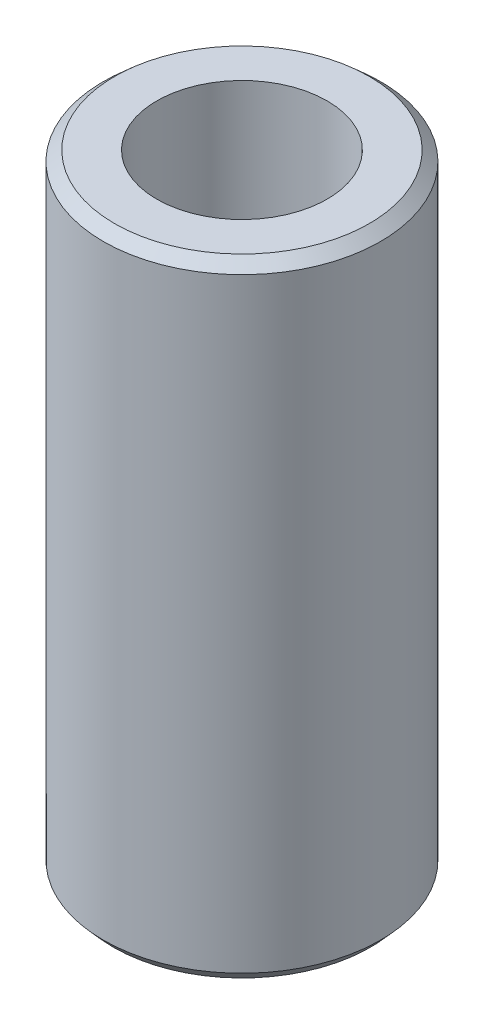
ISO-10303-21;
HEADER;
FILE_DESCRIPTION(('STEP AP214'),'2;1');
FILE_NAME('part.step','',(''),(''),'','','');
FILE_SCHEMA(('AUTOMOTIVE_DESIGN { 1 0 10303 214 1 1 1 1 }'));
ENDSEC;
DATA;
#1=APPLICATION_CONTEXT('core data for automotive mechanical design processes');
#2=APPLICATION_PROTOCOL_DEFINITION('international standard','automotive_design',2000,#1);
#3=PRODUCT_CONTEXT('',#1,'mechanical');
#4=PRODUCT('Part','Part','',(#3));
#5=PRODUCT_RELATED_PRODUCT_CATEGORY('part','',(#4));
#6=PRODUCT_DEFINITION_FORMATION('','',#4);
#7=PRODUCT_DEFINITION_CONTEXT('part definition',#1,'design');
#8=PRODUCT_DEFINITION('design','',#6,#7);
#9=PRODUCT_DEFINITION_SHAPE('','',#8);
#10=(LENGTH_UNIT() NAMED_UNIT(*) SI_UNIT(.MILLI.,.METRE.));
#11=(NAMED_UNIT(*) PLANE_ANGLE_UNIT() SI_UNIT($,.RADIAN.));
#12=(NAMED_UNIT(*) SI_UNIT($,.STERADIAN.) SOLID_ANGLE_UNIT());
#13=UNCERTAINTY_MEASURE_WITH_UNIT(LENGTH_MEASURE(1.E-05),#10,'distance_accuracy_value','');
#14=(GEOMETRIC_REPRESENTATION_CONTEXT(3) GLOBAL_UNCERTAINTY_ASSIGNED_CONTEXT((#13)) GLOBAL_UNIT_ASSIGNED_CONTEXT((#10,
#11,#12)) REPRESENTATION_CONTEXT('',''));
#15=CARTESIAN_POINT('',(0.,0.,0.));
#16=DIRECTION('',(0.,0.,1.));
#17=DIRECTION('',(1.,0.,0.));
#18=AXIS2_PLACEMENT_3D('',#15,#16,#17);
#19=CARTESIAN_POINT('',(0.,90.3573733337764,0.));
#20=DIRECTION('',(0.,-1.,0.));
#21=DIRECTION('',(0.,0.,-1.));
#22=AXIS2_PLACEMENT_3D('',#19,#20,#21);
#23=CYLINDRICAL_SURFACE('',#22,20.);
#24=CARTESIAN_POINT('',(0.,88.9192004763787,0.));
#25=DIRECTION('',(0.,1.,0.));
#26=DIRECTION('',(0.,0.,1.));
#27=AXIS2_PLACEMENT_3D('',#24,#25,#26);
#28=CIRCLE('',#27,20.);
#29=CARTESIAN_POINT('',(0.,88.9192004763787,20.));
#30=VERTEX_POINT('',#29);
#31=EDGE_CURVE('E50',#30,#30,#28,.F.);
#32=ORIENTED_EDGE('',*,*,#31,.T.);
#33=EDGE_LOOP('',(#32));
#34=FACE_BOUND('',#33,.T.);
#35=CARTESIAN_POINT('',(0.,1.61076154303533,0.));
#36=DIRECTION('',(0.,1.,0.));
#37=DIRECTION('',(0.,0.,1.));
#38=AXIS2_PLACEMENT_3D('',#35,#36,#37);
#39=CIRCLE('',#38,20.);
#40=CARTESIAN_POINT('',(0.,1.61076154303533,20.));
#41=VERTEX_POINT('',#40);
#42=EDGE_CURVE('E51',#41,#41,#39,.T.);
#43=ORIENTED_EDGE('',*,*,#42,.T.);
#44=EDGE_LOOP('',(#43));
#45=FACE_BOUND('',#44,.T.);
#46=ADVANCED_FACE('F39',(#34,#45),#23,.T.);
#47=CARTESIAN_POINT('',(0.,90.3573733337764,0.));
#48=DIRECTION('',(0.,1.,0.));
#49=DIRECTION('',(0.,0.,1.));
#50=AXIS2_PLACEMENT_3D('',#47,#48,#49);
#51=PLANE('',#50);
#52=CARTESIAN_POINT('',(0.,90.3573733337764,0.));
#53=DIRECTION('',(0.,1.,0.));
#54=DIRECTION('',(0.,0.,1.));
#55=AXIS2_PLACEMENT_3D('',#52,#53,#54);
#56=CIRCLE('',#55,18.3892384569647);
#57=CARTESIAN_POINT('',(0.,90.3573733337764,18.3892384569647));
#58=VERTEX_POINT('',#57);
#59=EDGE_CURVE('E54',#58,#58,#56,.T.);
#60=ORIENTED_EDGE('',*,*,#59,.T.);
#61=EDGE_LOOP('',(#60));
#62=FACE_BOUND('',#61,.T.);
#63=CARTESIAN_POINT('',(0.,90.3573733337764,0.));
#64=DIRECTION('',(0.,1.,0.));
#65=DIRECTION('',(0.,0.,1.));
#66=AXIS2_PLACEMENT_3D('',#63,#64,#65);
#67=CIRCLE('',#66,12.2946007790817);
#68=CARTESIAN_POINT('',(0.,90.3573733337764,12.2946007790817));
#69=VERTEX_POINT('',#68);
#70=EDGE_CURVE('E58',#69,#69,#67,.T.);
#71=ORIENTED_EDGE('',*,*,#70,.F.);
#72=EDGE_LOOP('',(#71));
#73=FACE_BOUND('',#72,.T.);
#74=ADVANCED_FACE('F69',(#62,#73),#51,.T.);
#75=CARTESIAN_POINT('',(0.,0.,0.));
#76=DIRECTION('',(0.,1.,0.));
#77=DIRECTION('',(0.,0.,1.));
#78=AXIS2_PLACEMENT_3D('',#75,#76,#77);
#79=PLANE('',#78);
#80=CARTESIAN_POINT('',(0.,0.,0.));
#81=DIRECTION('',(0.,1.,0.));
#82=DIRECTION('',(0.,0.,1.));
#83=AXIS2_PLACEMENT_3D('',#80,#81,#82);
#84=CIRCLE('',#83,18.5618271426023);
#85=CARTESIAN_POINT('',(0.,0.,18.5618271426023));
#86=VERTEX_POINT('',#85);
#87=EDGE_CURVE('E10',#86,#86,#84,.F.);
#88=ORIENTED_EDGE('',*,*,#87,.T.);
#89=EDGE_LOOP('',(#88));
#90=FACE_BOUND('',#89,.T.);
#91=CARTESIAN_POINT('',(0.,0.,0.));
#92=DIRECTION('',(0.,1.,0.));
#93=DIRECTION('',(0.,0.,1.));
#94=AXIS2_PLACEMENT_3D('',#91,#92,#93);
#95=CIRCLE('',#94,12.2946007790817);
#96=CARTESIAN_POINT('',(0.,0.,12.2946007790817));
#97=VERTEX_POINT('',#96);
#98=EDGE_CURVE('E63',#97,#97,#95,.T.);
#99=ORIENTED_EDGE('',*,*,#98,.T.);
#100=EDGE_LOOP('',(#99));
#101=FACE_BOUND('',#100,.T.);
#102=ADVANCED_FACE('F75',(#90,#101),#79,.F.);
#103=CARTESIAN_POINT('',(0.,90.3573733337764,0.));
#104=DIRECTION('',(0.,-1.,0.));
#105=DIRECTION('',(0.,0.,-1.));
#106=AXIS2_PLACEMENT_3D('',#103,#104,#105);
#107=CYLINDRICAL_SURFACE('',#106,12.2946007790817);
#108=ORIENTED_EDGE('',*,*,#70,.T.);
#109=EDGE_LOOP('',(#108));
#110=FACE_BOUND('',#109,.T.);
#111=ORIENTED_EDGE('',*,*,#98,.F.);
#112=EDGE_LOOP('',(#111));
#113=FACE_BOUND('',#112,.T.);
#114=ADVANCED_FACE('F70',(#110,#113),#107,.F.);
#115=CARTESIAN_POINT('',(0.,90.3573733337764,0.));
#116=DIRECTION('',(0.,-1.,0.));
#117=DIRECTION('',(0.,0.,-1.));
#118=AXIS2_PLACEMENT_3D('',#115,#116,#117);
#119=CONICAL_SURFACE('',#118,18.3892384569647,0.841944050125375);
#120=ORIENTED_EDGE('',*,*,#31,.F.);
#121=EDGE_LOOP('',(#120));
#122=FACE_BOUND('',#121,.T.);
#123=ORIENTED_EDGE('',*,*,#59,.F.);
#124=EDGE_LOOP('',(#123));
#125=FACE_BOUND('',#124,.T.);
#126=ADVANCED_FACE('F81',(#122,#125),#119,.T.);
#127=CARTESIAN_POINT('',(0.,1.61076154303533,0.));
#128=DIRECTION('',(0.,1.,0.));
#129=DIRECTION('',(0.,0.,1.));
#130=AXIS2_PLACEMENT_3D('',#127,#128,#129);
#131=CONICAL_SURFACE('',#130,20.,0.728852276669526);
#132=ORIENTED_EDGE('',*,*,#87,.F.);
#133=EDGE_LOOP('',(#132));
#134=FACE_BOUND('',#133,.T.);
#135=ORIENTED_EDGE('',*,*,#42,.F.);
#136=EDGE_LOOP('',(#135));
#137=FACE_BOUND('',#136,.T.);
#138=ADVANCED_FACE('F45',(#134,#137),#131,.T.);
#139=CLOSED_SHELL('',(#46,#74,#102,#114,#126,#138));
#140=MANIFOLD_SOLID_BREP('B2',#139);
#141=ADVANCED_BREP_SHAPE_REPRESENTATION('',(#18,#140),#14);
#142=SHAPE_DEFINITION_REPRESENTATION(#9,#141);
ENDSEC;
END-ISO-10303-21;
